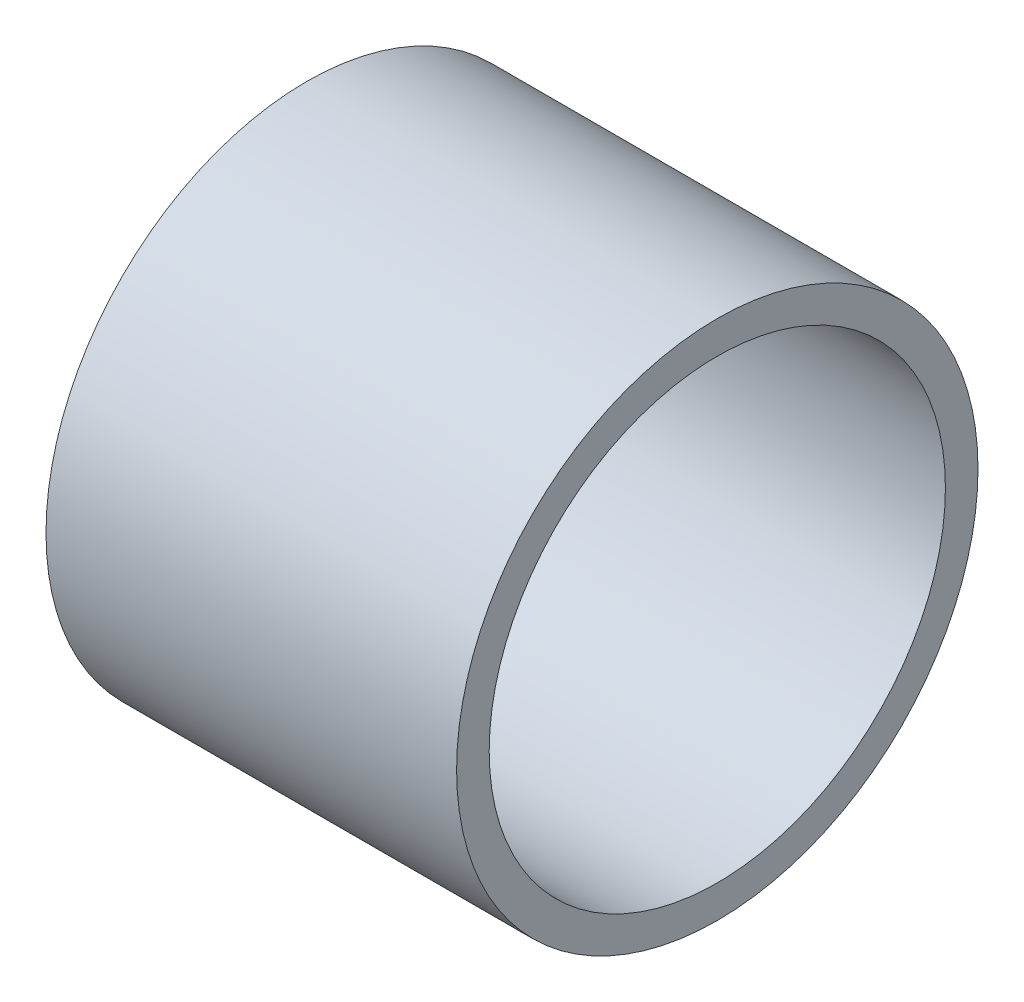
ISO-10303-21;
HEADER;
FILE_DESCRIPTION(('STEP AP214'),'2;1');
FILE_NAME('part.step','',(''),(''),'','','');
FILE_SCHEMA(('AUTOMOTIVE_DESIGN { 1 0 10303 214 1 1 1 1 }'));
ENDSEC;
DATA;
#1=APPLICATION_CONTEXT('core data for automotive mechanical design processes');
#2=APPLICATION_PROTOCOL_DEFINITION('international standard','automotive_design',2000,#1);
#3=PRODUCT_CONTEXT('',#1,'mechanical');
#4=PRODUCT('Part','Part','',(#3));
#5=PRODUCT_RELATED_PRODUCT_CATEGORY('part','',(#4));
#6=PRODUCT_DEFINITION_FORMATION('','',#4);
#7=PRODUCT_DEFINITION_CONTEXT('part definition',#1,'design');
#8=PRODUCT_DEFINITION('design','',#6,#7);
#9=PRODUCT_DEFINITION_SHAPE('','',#8);
#10=(LENGTH_UNIT() NAMED_UNIT(*) SI_UNIT(.MILLI.,.METRE.));
#11=(NAMED_UNIT(*) PLANE_ANGLE_UNIT() SI_UNIT($,.RADIAN.));
#12=(NAMED_UNIT(*) SI_UNIT($,.STERADIAN.) SOLID_ANGLE_UNIT());
#13=UNCERTAINTY_MEASURE_WITH_UNIT(LENGTH_MEASURE(1.E-05),#10,'distance_accuracy_value','');
#14=(GEOMETRIC_REPRESENTATION_CONTEXT(3) GLOBAL_UNCERTAINTY_ASSIGNED_CONTEXT((#13)) GLOBAL_UNIT_ASSIGNED_CONTEXT((#10,
#11,#12)) REPRESENTATION_CONTEXT('',''));
#15=CARTESIAN_POINT('',(0.,0.,0.));
#16=DIRECTION('',(0.,0.,1.));
#17=DIRECTION('',(1.,0.,0.));
#18=AXIS2_PLACEMENT_3D('',#15,#16,#17);
#19=CARTESIAN_POINT('',(-6.3,0.,0.));
#20=DIRECTION('',(1.,0.,0.));
#21=DIRECTION('',(0.,0.,-1.));
#22=AXIS2_PLACEMENT_3D('',#19,#20,#21);
#23=CYLINDRICAL_SURFACE('',#22,8.);
#24=CARTESIAN_POINT('',(-6.3,0.,0.));
#25=DIRECTION('',(1.,0.,0.));
#26=DIRECTION('',(0.,0.,-1.));
#27=AXIS2_PLACEMENT_3D('',#24,#25,#26);
#28=CIRCLE('',#27,8.);
#29=CARTESIAN_POINT('',(-6.3,0.,-8.));
#30=VERTEX_POINT('',#29);
#31=EDGE_CURVE('E10',#30,#30,#28,.T.);
#32=ORIENTED_EDGE('',*,*,#31,.T.);
#33=EDGE_LOOP('',(#32));
#34=FACE_BOUND('',#33,.T.);
#35=CARTESIAN_POINT('',(6.3,0.,0.));
#36=DIRECTION('',(1.,0.,0.));
#37=DIRECTION('',(0.,0.,-1.));
#38=AXIS2_PLACEMENT_3D('',#35,#36,#37);
#39=CIRCLE('',#38,8.);
#40=CARTESIAN_POINT('',(6.3,0.,-8.));
#41=VERTEX_POINT('',#40);
#42=EDGE_CURVE('E45',#41,#41,#39,.T.);
#43=ORIENTED_EDGE('',*,*,#42,.F.);
#44=EDGE_LOOP('',(#43));
#45=FACE_BOUND('',#44,.T.);
#46=ADVANCED_FACE('F35',(#34,#45),#23,.T.);
#47=CARTESIAN_POINT('',(-6.3,0.,0.));
#48=DIRECTION('',(1.,0.,0.));
#49=DIRECTION('',(0.,0.,-1.));
#50=AXIS2_PLACEMENT_3D('',#47,#48,#49);
#51=PLANE('',#50);
#52=CARTESIAN_POINT('',(-6.3,0.,0.));
#53=DIRECTION('',(1.,0.,0.));
#54=DIRECTION('',(0.,0.,-1.));
#55=AXIS2_PLACEMENT_3D('',#52,#53,#54);
#56=CIRCLE('',#55,7.);
#57=CARTESIAN_POINT('',(-6.3,0.,-7.));
#58=VERTEX_POINT('',#57);
#59=EDGE_CURVE('E41',#58,#58,#56,.T.);
#60=ORIENTED_EDGE('',*,*,#59,.T.);
#61=EDGE_LOOP('',(#60));
#62=FACE_BOUND('',#61,.T.);
#63=ORIENTED_EDGE('',*,*,#31,.F.);
#64=EDGE_LOOP('',(#63));
#65=FACE_BOUND('',#64,.T.);
#66=ADVANCED_FACE('F64',(#62,#65),#51,.F.);
#67=CARTESIAN_POINT('',(-6.3,0.,0.));
#68=DIRECTION('',(1.,0.,0.));
#69=DIRECTION('',(0.,0.,-1.));
#70=AXIS2_PLACEMENT_3D('',#67,#68,#69);
#71=CYLINDRICAL_SURFACE('',#70,7.);
#72=ORIENTED_EDGE('',*,*,#59,.F.);
#73=EDGE_LOOP('',(#72));
#74=FACE_BOUND('',#73,.T.);
#75=CARTESIAN_POINT('',(6.3,0.,0.));
#76=DIRECTION('',(1.,0.,0.));
#77=DIRECTION('',(0.,0.,-1.));
#78=AXIS2_PLACEMENT_3D('',#75,#76,#77);
#79=CIRCLE('',#78,7.);
#80=CARTESIAN_POINT('',(6.3,0.,-7.));
#81=VERTEX_POINT('',#80);
#82=EDGE_CURVE('E49',#81,#81,#79,.T.);
#83=ORIENTED_EDGE('',*,*,#82,.T.);
#84=EDGE_LOOP('',(#83));
#85=FACE_BOUND('',#84,.T.);
#86=ADVANCED_FACE('F55',(#74,#85),#71,.F.);
#87=CARTESIAN_POINT('',(6.3,0.,0.));
#88=DIRECTION('',(1.,0.,0.));
#89=DIRECTION('',(0.,0.,-1.));
#90=AXIS2_PLACEMENT_3D('',#87,#88,#89);
#91=PLANE('',#90);
#92=ORIENTED_EDGE('',*,*,#42,.T.);
#93=EDGE_LOOP('',(#92));
#94=FACE_BOUND('',#93,.T.);
#95=ORIENTED_EDGE('',*,*,#82,.F.);
#96=EDGE_LOOP('',(#95));
#97=FACE_BOUND('',#96,.T.);
#98=ADVANCED_FACE('F57',(#94,#97),#91,.T.);
#99=CLOSED_SHELL('',(#46,#66,#86,#98));
#100=MANIFOLD_SOLID_BREP('B2',#99);
#101=ADVANCED_BREP_SHAPE_REPRESENTATION('',(#18,#100),#14);
#102=SHAPE_DEFINITION_REPRESENTATION(#9,#101);
ENDSEC;
END-ISO-10303-21;
